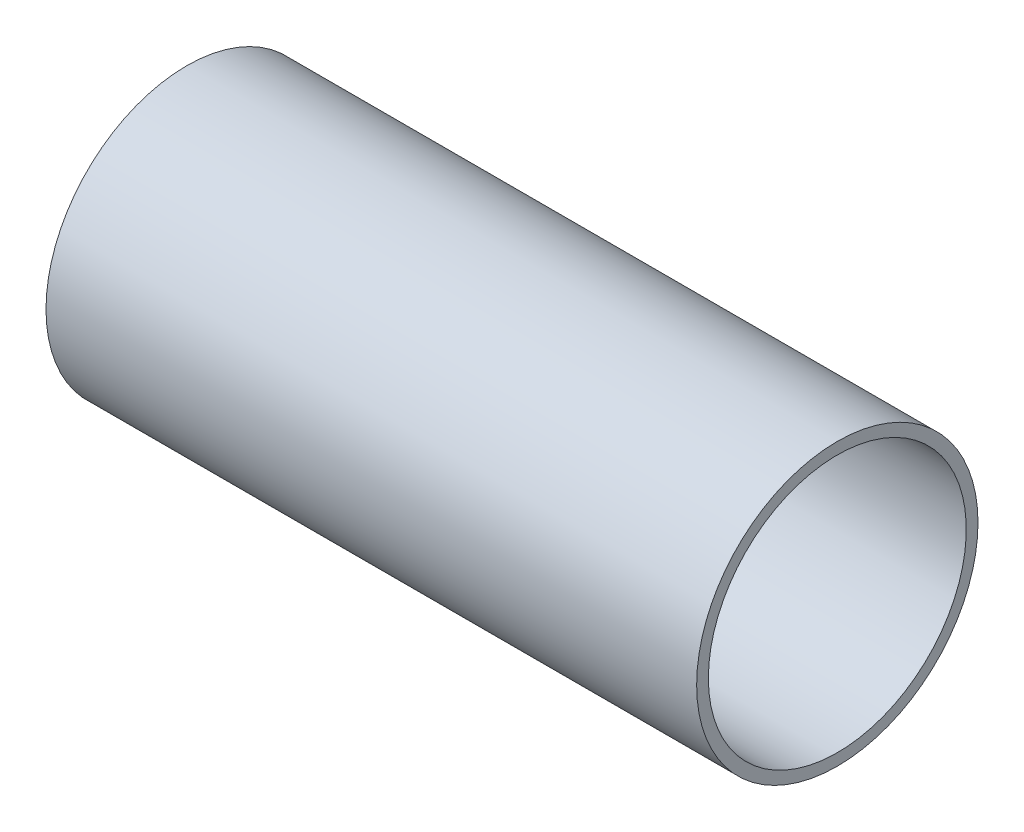
ISO-10303-21;
HEADER;
FILE_DESCRIPTION(('STEP AP214'),'2;1');
FILE_NAME('part.step','',(''),(''),'','','');
FILE_SCHEMA(('AUTOMOTIVE_DESIGN { 1 0 10303 214 1 1 1 1 }'));
ENDSEC;
DATA;
#1=APPLICATION_CONTEXT('core data for automotive mechanical design processes');
#2=APPLICATION_PROTOCOL_DEFINITION('international standard','automotive_design',2000,#1);
#3=PRODUCT_CONTEXT('',#1,'mechanical');
#4=PRODUCT('Part','Part','',(#3));
#5=PRODUCT_RELATED_PRODUCT_CATEGORY('part','',(#4));
#6=PRODUCT_DEFINITION_FORMATION('','',#4);
#7=PRODUCT_DEFINITION_CONTEXT('part definition',#1,'design');
#8=PRODUCT_DEFINITION('design','',#6,#7);
#9=PRODUCT_DEFINITION_SHAPE('','',#8);
#10=(LENGTH_UNIT() NAMED_UNIT(*) SI_UNIT(.MILLI.,.METRE.));
#11=(NAMED_UNIT(*) PLANE_ANGLE_UNIT() SI_UNIT($,.RADIAN.));
#12=(NAMED_UNIT(*) SI_UNIT($,.STERADIAN.) SOLID_ANGLE_UNIT());
#13=UNCERTAINTY_MEASURE_WITH_UNIT(LENGTH_MEASURE(1.E-05),#10,'distance_accuracy_value','');
#14=(GEOMETRIC_REPRESENTATION_CONTEXT(3) GLOBAL_UNCERTAINTY_ASSIGNED_CONTEXT((#13)) GLOBAL_UNIT_ASSIGNED_CONTEXT((#10,
#11,#12)) REPRESENTATION_CONTEXT('',''));
#15=CARTESIAN_POINT('',(0.,0.,0.));
#16=DIRECTION('',(0.,0.,1.));
#17=DIRECTION('',(1.,0.,0.));
#18=AXIS2_PLACEMENT_3D('',#15,#16,#17);
#19=CARTESIAN_POINT('',(88.10625,0.,0.));
#20=DIRECTION('',(-1.,0.,0.));
#21=DIRECTION('',(0.,0.,1.));
#22=AXIS2_PLACEMENT_3D('',#19,#20,#21);
#23=CYLINDRICAL_SURFACE('',#22,38.1);
#24=CARTESIAN_POINT('',(88.10625,0.,0.));
#25=DIRECTION('',(1.,0.,0.));
#26=DIRECTION('',(0.,0.,-1.));
#27=AXIS2_PLACEMENT_3D('',#24,#25,#26);
#28=CIRCLE('',#27,38.1);
#29=CARTESIAN_POINT('',(88.10625,0.,38.1));
#30=VERTEX_POINT('',#29);
#31=EDGE_CURVE('E10',#30,#30,#28,.T.);
#32=CARTESIAN_POINT('',(-88.10625,0.,0.));
#33=DIRECTION('',(1.,0.,0.));
#34=DIRECTION('',(0.,0.,-1.));
#35=AXIS2_PLACEMENT_3D('',#32,#33,#34);
#36=CIRCLE('',#35,38.1);
#37=CARTESIAN_POINT('',(-88.10625,0.,38.1));
#38=VERTEX_POINT('',#37);
#39=EDGE_CURVE('E35',#38,#38,#36,.T.);
#40=CARTESIAN_POINT('',(88.10625,0.,38.1));
#41=CARTESIAN_POINT('',(86.270703125,0.,38.1));
#42=CARTESIAN_POINT('',(84.43515625,0.,38.1));
#43=CARTESIAN_POINT('',(80.7640625,0.,38.1));
#44=CARTESIAN_POINT('',(78.928515625,0.,38.1));
#45=CARTESIAN_POINT('',(75.257421875,0.,38.1));
#46=CARTESIAN_POINT('',(73.421875,0.,38.1));
#47=CARTESIAN_POINT('',(69.75078125,0.,38.1));
#48=CARTESIAN_POINT('',(67.915234375,0.,38.1));
#49=CARTESIAN_POINT('',(64.244140625,0.,38.1));
#50=CARTESIAN_POINT('',(62.40859375,0.,38.1));
#51=CARTESIAN_POINT('',(58.7375,0.,38.1));
#52=CARTESIAN_POINT('',(56.901953125,0.,38.1));
#53=CARTESIAN_POINT('',(53.230859375,0.,38.1));
#54=CARTESIAN_POINT('',(51.3953125,0.,38.1));
#55=CARTESIAN_POINT('',(47.72421875,0.,38.1));
#56=CARTESIAN_POINT('',(45.888671875,0.,38.1));
#57=CARTESIAN_POINT('',(42.217578125,0.,38.1));
#58=CARTESIAN_POINT('',(40.38203125,0.,38.1));
#59=CARTESIAN_POINT('',(36.7109375,0.,38.1));
#60=CARTESIAN_POINT('',(34.875390625,0.,38.1));
#61=CARTESIAN_POINT('',(31.204296875,0.,38.1));
#62=CARTESIAN_POINT('',(29.36875,0.,38.1));
#63=CARTESIAN_POINT('',(25.69765625,0.,38.1));
#64=CARTESIAN_POINT('',(23.862109375,0.,38.1));
#65=CARTESIAN_POINT('',(20.191015625,0.,38.1));
#66=CARTESIAN_POINT('',(18.35546875,0.,38.1));
#67=CARTESIAN_POINT('',(14.684375,0.,38.1));
#68=CARTESIAN_POINT('',(12.848828125,0.,38.1));
#69=CARTESIAN_POINT('',(9.17773437499999,0.,38.1));
#70=CARTESIAN_POINT('',(7.34218749999999,0.,38.1));
#71=CARTESIAN_POINT('',(3.67109374999999,0.,38.1));
#72=CARTESIAN_POINT('',(1.83554687499999,0.,38.1));
#73=CARTESIAN_POINT('',(-1.83554687500001,0.,38.1));
#74=CARTESIAN_POINT('',(-3.67109375000002,0.,38.1));
#75=CARTESIAN_POINT('',(-7.34218750000002,0.,38.1));
#76=CARTESIAN_POINT('',(-9.17773437500002,0.,38.1));
#77=CARTESIAN_POINT('',(-12.848828125,0.,38.1));
#78=CARTESIAN_POINT('',(-14.684375,0.,38.1));
#79=CARTESIAN_POINT('',(-18.35546875,0.,38.1));
#80=CARTESIAN_POINT('',(-20.191015625,0.,38.1));
#81=CARTESIAN_POINT('',(-23.862109375,0.,38.1));
#82=CARTESIAN_POINT('',(-25.69765625,0.,38.1));
#83=CARTESIAN_POINT('',(-29.36875,0.,38.1));
#84=CARTESIAN_POINT('',(-31.204296875,0.,38.1));
#85=CARTESIAN_POINT('',(-34.875390625,0.,38.1));
#86=CARTESIAN_POINT('',(-36.7109375,0.,38.1));
#87=CARTESIAN_POINT('',(-40.38203125,0.,38.1));
#88=CARTESIAN_POINT('',(-42.217578125,0.,38.1));
#89=CARTESIAN_POINT('',(-45.888671875,0.,38.1));
#90=CARTESIAN_POINT('',(-47.72421875,0.,38.1));
#91=CARTESIAN_POINT('',(-51.3953125,0.,38.1));
#92=CARTESIAN_POINT('',(-53.230859375,0.,38.1));
#93=CARTESIAN_POINT('',(-56.901953125,0.,38.1));
#94=CARTESIAN_POINT('',(-58.7375,0.,38.1));
#95=CARTESIAN_POINT('',(-62.40859375,0.,38.1));
#96=CARTESIAN_POINT('',(-64.244140625,0.,38.1));
#97=CARTESIAN_POINT('',(-67.915234375,0.,38.1));
#98=CARTESIAN_POINT('',(-69.75078125,0.,38.1));
#99=CARTESIAN_POINT('',(-73.421875,0.,38.1));
#100=CARTESIAN_POINT('',(-75.257421875,0.,38.1));
#101=CARTESIAN_POINT('',(-78.928515625,0.,38.1));
#102=CARTESIAN_POINT('',(-80.7640625,0.,38.1));
#103=CARTESIAN_POINT('',(-84.43515625,0.,38.1));
#104=CARTESIAN_POINT('',(-86.270703125,0.,38.1));
#105=CARTESIAN_POINT('',(-88.10625,0.,38.1));
#106=B_SPLINE_CURVE_WITH_KNOTS('',3,(#40,#41,#42,#43,#44,#45,#46,#47,#48,#49,#50,#51,#52,#53,
#54,#55,#56,#57,#58,#59,#60,#61,#62,#63,#64,#65,#66,#67,#68,#69,#70,#71,#72,#73,#74,#75,#76,#77,
#78,#79,#80,#81,#82,#83,#84,#85,#86,#87,#88,#89,#90,#91,#92,#93,#94,#95,#96,#97,#98,#99,#100,
#101,#102,#103,#104,#105),.UNSPECIFIED.,.F.,.F.,(4,2,2,2,2,2,2,2,2,2,2,2,2,2,2,2,2,2,2,2,2,2,2,
2,2,2,2,2,2,2,2,2,4),(0.,5.506640625,11.01328125,16.519921875,22.0265625,27.533203125,
33.03984375,38.546484375,44.053125,49.559765625,55.06640625,60.573046875,66.0796875,
71.586328125,77.09296875,82.599609375,88.10625,93.612890625,99.11953125,104.626171875,
110.1328125,115.639453125,121.14609375,126.652734375,132.159375,137.666015625,143.17265625,
148.679296875,154.1859375,159.692578125,165.19921875,170.705859375,176.2125),.UNSPECIFIED.);
#107=EDGE_CURVE('BSEAM32',#30,#38,#106,.T.);
#108=ORIENTED_EDGE('',*,*,#31,.F.);
#109=ORIENTED_EDGE('',*,*,#39,.T.);
#110=ORIENTED_EDGE('',*,*,#107,.T.);
#111=ORIENTED_EDGE('',*,*,#107,.F.);
#112=EDGE_LOOP('',(#108,#110,#109,#111));
#113=FACE_BOUND('',#112,.T.);
#114=ADVANCED_FACE('F32',(#113),#23,.T.);
#115=CARTESIAN_POINT('',(88.10625,0.,0.));
#116=DIRECTION('',(1.,0.,0.));
#117=DIRECTION('',(0.,0.,-1.));
#118=AXIS2_PLACEMENT_3D('',#115,#116,#117);
#119=PLANE('',#118);
#120=CARTESIAN_POINT('',(88.10625,0.,0.));
#121=DIRECTION('',(1.,0.,0.));
#122=DIRECTION('',(0.,0.,-1.));
#123=AXIS2_PLACEMENT_3D('',#120,#121,#122);
#124=CIRCLE('',#123,34.925);
#125=CARTESIAN_POINT('',(88.10625,0.,34.925));
#126=VERTEX_POINT('',#125);
#127=EDGE_CURVE('E42',#126,#126,#124,.T.);
#128=ORIENTED_EDGE('',*,*,#127,.F.);
#129=EDGE_LOOP('',(#128));
#130=FACE_BOUND('',#129,.T.);
#131=ORIENTED_EDGE('',*,*,#31,.T.);
#132=EDGE_LOOP('',(#131));
#133=FACE_BOUND('',#132,.T.);
#134=ADVANCED_FACE('F53',(#130,#133),#119,.T.);
#135=CARTESIAN_POINT('',(-88.10625,0.,0.));
#136=DIRECTION('',(1.,0.,0.));
#137=DIRECTION('',(0.,0.,-1.));
#138=AXIS2_PLACEMENT_3D('',#135,#136,#137);
#139=PLANE('',#138);
#140=CARTESIAN_POINT('',(-88.10625,0.,0.));
#141=DIRECTION('',(1.,0.,0.));
#142=DIRECTION('',(0.,0.,-1.));
#143=AXIS2_PLACEMENT_3D('',#140,#141,#142);
#144=CIRCLE('',#143,34.925);
#145=CARTESIAN_POINT('',(-88.10625,0.,34.925));
#146=VERTEX_POINT('',#145);
#147=EDGE_CURVE('E44',#146,#146,#144,.T.);
#148=ORIENTED_EDGE('',*,*,#147,.T.);
#149=EDGE_LOOP('',(#148));
#150=FACE_BOUND('',#149,.T.);
#151=ORIENTED_EDGE('',*,*,#39,.F.);
#152=EDGE_LOOP('',(#151));
#153=FACE_BOUND('',#152,.T.);
#154=ADVANCED_FACE('F55',(#150,#153),#139,.F.);
#155=CARTESIAN_POINT('',(88.10625,0.,0.));
#156=DIRECTION('',(-1.,0.,0.));
#157=DIRECTION('',(0.,0.,1.));
#158=AXIS2_PLACEMENT_3D('',#155,#156,#157);
#159=CYLINDRICAL_SURFACE('',#158,34.925);
#160=CARTESIAN_POINT('',(88.10625,0.,34.925));
#161=CARTESIAN_POINT('',(86.270703125,0.,34.925));
#162=CARTESIAN_POINT('',(84.43515625,0.,34.925));
#163=CARTESIAN_POINT('',(80.7640625,0.,34.925));
#164=CARTESIAN_POINT('',(78.928515625,0.,34.925));
#165=CARTESIAN_POINT('',(75.257421875,0.,34.925));
#166=CARTESIAN_POINT('',(73.421875,0.,34.925));
#167=CARTESIAN_POINT('',(69.75078125,0.,34.925));
#168=CARTESIAN_POINT('',(67.915234375,0.,34.925));
#169=CARTESIAN_POINT('',(64.244140625,0.,34.925));
#170=CARTESIAN_POINT('',(62.40859375,0.,34.925));
#171=CARTESIAN_POINT('',(58.7375,0.,34.925));
#172=CARTESIAN_POINT('',(56.901953125,0.,34.925));
#173=CARTESIAN_POINT('',(53.230859375,0.,34.925));
#174=CARTESIAN_POINT('',(51.3953125,0.,34.925));
#175=CARTESIAN_POINT('',(47.72421875,0.,34.925));
#176=CARTESIAN_POINT('',(45.888671875,0.,34.925));
#177=CARTESIAN_POINT('',(42.217578125,0.,34.925));
#178=CARTESIAN_POINT('',(40.38203125,0.,34.925));
#179=CARTESIAN_POINT('',(36.7109375,0.,34.925));
#180=CARTESIAN_POINT('',(34.875390625,0.,34.925));
#181=CARTESIAN_POINT('',(31.204296875,0.,34.925));
#182=CARTESIAN_POINT('',(29.36875,0.,34.925));
#183=CARTESIAN_POINT('',(25.69765625,0.,34.925));
#184=CARTESIAN_POINT('',(23.862109375,0.,34.925));
#185=CARTESIAN_POINT('',(20.191015625,0.,34.925));
#186=CARTESIAN_POINT('',(18.35546875,0.,34.925));
#187=CARTESIAN_POINT('',(14.684375,0.,34.925));
#188=CARTESIAN_POINT('',(12.848828125,0.,34.925));
#189=CARTESIAN_POINT('',(9.17773437499999,0.,34.925));
#190=CARTESIAN_POINT('',(7.34218749999999,0.,34.925));
#191=CARTESIAN_POINT('',(3.67109374999999,0.,34.925));
#192=CARTESIAN_POINT('',(1.83554687499999,0.,34.925));
#193=CARTESIAN_POINT('',(-1.83554687500001,0.,34.925));
#194=CARTESIAN_POINT('',(-3.67109375000002,0.,34.925));
#195=CARTESIAN_POINT('',(-7.34218750000002,0.,34.925));
#196=CARTESIAN_POINT('',(-9.17773437500002,0.,34.925));
#197=CARTESIAN_POINT('',(-12.848828125,0.,34.925));
#198=CARTESIAN_POINT('',(-14.684375,0.,34.925));
#199=CARTESIAN_POINT('',(-18.35546875,0.,34.925));
#200=CARTESIAN_POINT('',(-20.191015625,0.,34.925));
#201=CARTESIAN_POINT('',(-23.862109375,0.,34.925));
#202=CARTESIAN_POINT('',(-25.69765625,0.,34.925));
#203=CARTESIAN_POINT('',(-29.36875,0.,34.925));
#204=CARTESIAN_POINT('',(-31.204296875,0.,34.925));
#205=CARTESIAN_POINT('',(-34.875390625,0.,34.925));
#206=CARTESIAN_POINT('',(-36.7109375,0.,34.925));
#207=CARTESIAN_POINT('',(-40.38203125,0.,34.925));
#208=CARTESIAN_POINT('',(-42.217578125,0.,34.925));
#209=CARTESIAN_POINT('',(-45.888671875,0.,34.925));
#210=CARTESIAN_POINT('',(-47.72421875,0.,34.925));
#211=CARTESIAN_POINT('',(-51.3953125,0.,34.925));
#212=CARTESIAN_POINT('',(-53.230859375,0.,34.925));
#213=CARTESIAN_POINT('',(-56.901953125,0.,34.925));
#214=CARTESIAN_POINT('',(-58.7375,0.,34.925));
#215=CARTESIAN_POINT('',(-62.40859375,0.,34.925));
#216=CARTESIAN_POINT('',(-64.244140625,0.,34.925));
#217=CARTESIAN_POINT('',(-67.915234375,0.,34.925));
#218=CARTESIAN_POINT('',(-69.75078125,0.,34.925));
#219=CARTESIAN_POINT('',(-73.421875,0.,34.925));
#220=CARTESIAN_POINT('',(-75.257421875,0.,34.925));
#221=CARTESIAN_POINT('',(-78.928515625,0.,34.925));
#222=CARTESIAN_POINT('',(-80.7640625,0.,34.925));
#223=CARTESIAN_POINT('',(-84.43515625,0.,34.925));
#224=CARTESIAN_POINT('',(-86.270703125,0.,34.925));
#225=CARTESIAN_POINT('',(-88.10625,0.,34.925));
#226=B_SPLINE_CURVE_WITH_KNOTS('',3,(#160,#161,#162,#163,#164,#165,#166,#167,#168,#169,#170,
#171,#172,#173,#174,#175,#176,#177,#178,#179,#180,#181,#182,#183,#184,#185,#186,#187,#188,#189,
#190,#191,#192,#193,#194,#195,#196,#197,#198,#199,#200,#201,#202,#203,#204,#205,#206,#207,#208,
#209,#210,#211,#212,#213,#214,#215,#216,#217,#218,#219,#220,#221,#222,#223,#224,#225),
.UNSPECIFIED.,.F.,.F.,(4,2,2,2,2,2,2,2,2,2,2,2,2,2,2,2,2,2,2,2,2,2,2,2,2,2,2,2,2,2,2,2,4),(0.,
5.506640625,11.01328125,16.519921875,22.0265625,27.533203125,33.03984375,38.546484375,44.053125,
49.559765625,55.06640625,60.573046875,66.0796875,71.586328125,77.09296875,82.599609375,88.10625,
93.612890625,99.11953125,104.626171875,110.1328125,115.639453125,121.14609375,126.652734375,
132.159375,137.666015625,143.17265625,148.679296875,154.1859375,159.692578125,165.19921875,
170.705859375,176.2125),.UNSPECIFIED.);
#227=EDGE_CURVE('BSEAM50',#126,#146,#226,.T.);
#228=ORIENTED_EDGE('',*,*,#127,.T.);
#229=ORIENTED_EDGE('',*,*,#147,.F.);
#230=ORIENTED_EDGE('',*,*,#227,.T.);
#231=ORIENTED_EDGE('',*,*,#227,.F.);
#232=EDGE_LOOP('',(#228,#230,#229,#231));
#233=FACE_BOUND('',#232,.T.);
#234=ADVANCED_FACE('F50',(#233),#159,.F.);
#235=CLOSED_SHELL('',(#114,#134,#154,#234));
#236=MANIFOLD_SOLID_BREP('B2',#235);
#237=ADVANCED_BREP_SHAPE_REPRESENTATION('',(#18,#236),#14);
#238=SHAPE_DEFINITION_REPRESENTATION(#9,#237);
ENDSEC;
END-ISO-10303-21;
